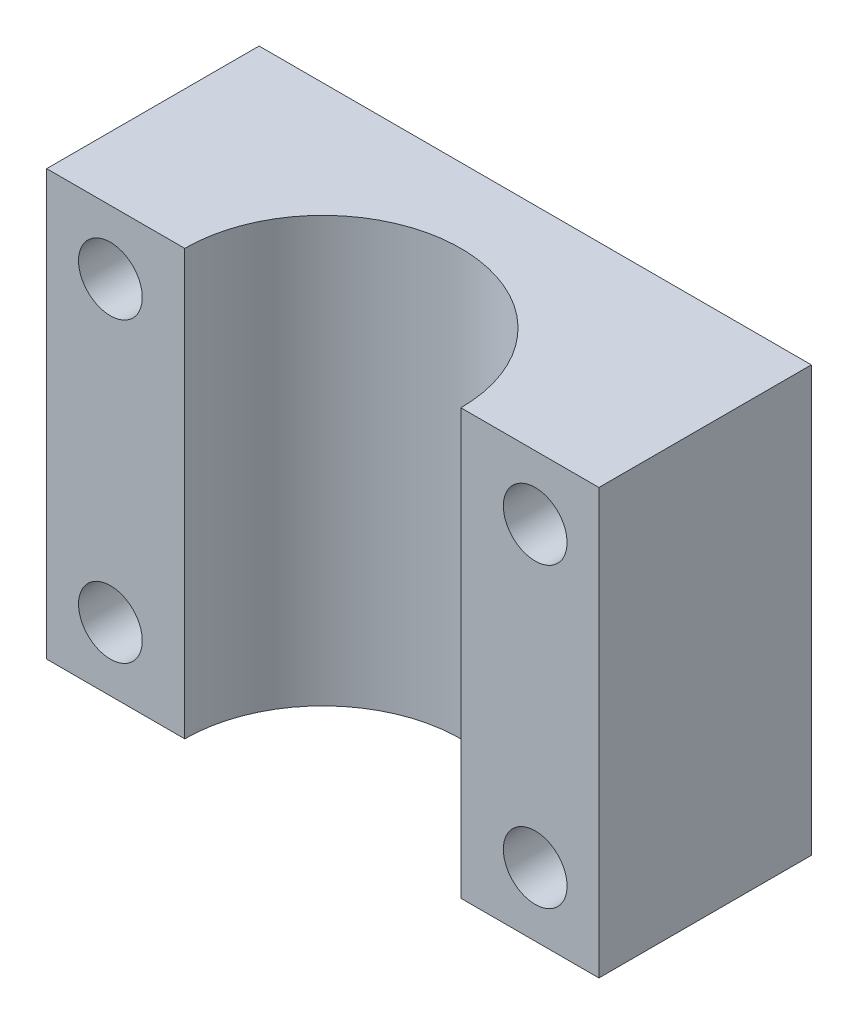
ISO-10303-21;
HEADER;
FILE_DESCRIPTION(('STEP AP214'),'2;1');
FILE_NAME('part.step','',(''),(''),'','','');
FILE_SCHEMA(('AUTOMOTIVE_DESIGN { 1 0 10303 214 1 1 1 1 }'));
ENDSEC;
DATA;
#1=APPLICATION_CONTEXT('core data for automotive mechanical design processes');
#2=APPLICATION_PROTOCOL_DEFINITION('international standard','automotive_design',2000,#1);
#3=PRODUCT_CONTEXT('',#1,'mechanical');
#4=PRODUCT('Part','Part','',(#3));
#5=PRODUCT_RELATED_PRODUCT_CATEGORY('part','',(#4));
#6=PRODUCT_DEFINITION_FORMATION('','',#4);
#7=PRODUCT_DEFINITION_CONTEXT('part definition',#1,'design');
#8=PRODUCT_DEFINITION('design','',#6,#7);
#9=PRODUCT_DEFINITION_SHAPE('','',#8);
#10=(LENGTH_UNIT() NAMED_UNIT(*) SI_UNIT(.MILLI.,.METRE.));
#11=(NAMED_UNIT(*) PLANE_ANGLE_UNIT() SI_UNIT($,.RADIAN.));
#12=(NAMED_UNIT(*) SI_UNIT($,.STERADIAN.) SOLID_ANGLE_UNIT());
#13=UNCERTAINTY_MEASURE_WITH_UNIT(LENGTH_MEASURE(1.E-05),#10,'distance_accuracy_value','');
#14=(GEOMETRIC_REPRESENTATION_CONTEXT(3) GLOBAL_UNCERTAINTY_ASSIGNED_CONTEXT((#13)) GLOBAL_UNIT_ASSIGNED_CONTEXT((#10,
#11,#12)) REPRESENTATION_CONTEXT('',''));
#15=CARTESIAN_POINT('',(0.,0.,0.));
#16=DIRECTION('',(0.,0.,1.));
#17=DIRECTION('',(1.,0.,0.));
#18=AXIS2_PLACEMENT_3D('',#15,#16,#17);
#19=CARTESIAN_POINT('',(0.,20.,0.));
#20=DIRECTION('',(0.,0.,-1.));
#21=DIRECTION('',(-1.,0.,0.));
#22=AXIS2_PLACEMENT_3D('',#19,#20,#21);
#23=PLANE('',#22);
#24=CARTESIAN_POINT('',(3.,3.,0.));
#25=DIRECTION('',(0.,0.,-1.));
#26=DIRECTION('',(-1.,0.,0.));
#27=AXIS2_PLACEMENT_3D('',#24,#25,#26);
#28=CIRCLE('',#27,1.5);
#29=CARTESIAN_POINT('',(1.5,3.,0.));
#30=VERTEX_POINT('',#29);
#31=EDGE_CURVE('E159',#30,#30,#28,.T.);
#32=ORIENTED_EDGE('',*,*,#31,.T.);
#33=EDGE_LOOP('',(#32));
#34=FACE_BOUND('',#33,.T.);
#35=CARTESIAN_POINT('',(3.,17.,0.));
#36=DIRECTION('',(0.,0.,-1.));
#37=DIRECTION('',(-1.,0.,0.));
#38=AXIS2_PLACEMENT_3D('',#35,#36,#37);
#39=CIRCLE('',#38,1.5);
#40=CARTESIAN_POINT('',(1.5,17.,0.));
#41=VERTEX_POINT('',#40);
#42=EDGE_CURVE('E147',#41,#41,#39,.T.);
#43=ORIENTED_EDGE('',*,*,#42,.T.);
#44=EDGE_LOOP('',(#43));
#45=FACE_BOUND('',#44,.T.);
#46=DIRECTION('',(1.,0.,0.));
#47=VECTOR('',#46,1.);
#48=CARTESIAN_POINT('',(0.,0.,0.));
#49=LINE('',#48,#47);
#50=CARTESIAN_POINT('',(0.,0.,0.));
#51=VERTEX_POINT('',#50);
#52=CARTESIAN_POINT('',(6.5,0.,0.));
#53=VERTEX_POINT('',#52);
#54=EDGE_CURVE('E120',#51,#53,#49,.T.);
#55=ORIENTED_EDGE('',*,*,#54,.T.);
#56=DIRECTION('',(0.,1.,0.));
#57=VECTOR('',#56,1.);
#58=CARTESIAN_POINT('',(6.5,0.,0.));
#59=LINE('',#58,#57);
#60=CARTESIAN_POINT('',(6.5,20.,0.));
#61=VERTEX_POINT('',#60);
#62=EDGE_CURVE('E54',#53,#61,#59,.T.);
#63=ORIENTED_EDGE('',*,*,#62,.T.);
#64=DIRECTION('',(1.,0.,0.));
#65=VECTOR('',#64,1.);
#66=CARTESIAN_POINT('',(0.,20.,0.));
#67=LINE('',#66,#65);
#68=CARTESIAN_POINT('',(0.,20.,0.));
#69=VERTEX_POINT('',#68);
#70=EDGE_CURVE('E90',#69,#61,#67,.T.);
#71=ORIENTED_EDGE('',*,*,#70,.F.);
#72=DIRECTION('',(0.,-1.,0.));
#73=VECTOR('',#72,1.);
#74=CARTESIAN_POINT('',(0.,20.,0.));
#75=LINE('',#74,#73);
#76=EDGE_CURVE('E11',#69,#51,#75,.T.);
#77=ORIENTED_EDGE('',*,*,#76,.T.);
#78=EDGE_LOOP('',(#55,#63,#71,#77));
#79=FACE_BOUND('',#78,.T.);
#80=ADVANCED_FACE('F39',(#34,#45,#79),#23,.F.);
#81=CARTESIAN_POINT('',(0.,20.,0.));
#82=DIRECTION('',(1.,0.,0.));
#83=DIRECTION('',(0.,0.,-1.));
#84=AXIS2_PLACEMENT_3D('',#81,#82,#83);
#85=PLANE('',#84);
#86=DIRECTION('',(0.,0.,1.));
#87=VECTOR('',#86,1.);
#88=CARTESIAN_POINT('',(0.,0.,0.));
#89=LINE('',#88,#87);
#90=CARTESIAN_POINT('',(0.,0.,-10.));
#91=VERTEX_POINT('',#90);
#92=EDGE_CURVE('E115',#91,#51,#89,.T.);
#93=ORIENTED_EDGE('',*,*,#92,.T.);
#94=ORIENTED_EDGE('',*,*,#76,.F.);
#95=DIRECTION('',(0.,0.,1.));
#96=VECTOR('',#95,1.);
#97=CARTESIAN_POINT('',(0.,20.,0.));
#98=LINE('',#97,#96);
#99=CARTESIAN_POINT('',(0.,20.,-10.));
#100=VERTEX_POINT('',#99);
#101=EDGE_CURVE('E128',#100,#69,#98,.T.);
#102=ORIENTED_EDGE('',*,*,#101,.F.);
#103=DIRECTION('',(0.,-1.,0.));
#104=VECTOR('',#103,1.);
#105=CARTESIAN_POINT('',(0.,20.,-10.));
#106=LINE('',#105,#104);
#107=EDGE_CURVE('E129',#100,#91,#106,.T.);
#108=ORIENTED_EDGE('',*,*,#107,.T.);
#109=EDGE_LOOP('',(#93,#94,#102,#108));
#110=FACE_BOUND('',#109,.T.);
#111=ADVANCED_FACE('F41',(#110),#85,.F.);
#112=CARTESIAN_POINT('',(23.,3.,0.));
#113=DIRECTION('',(0.,0.,-1.));
#114=DIRECTION('',(-1.,0.,0.));
#115=AXIS2_PLACEMENT_3D('',#112,#113,#114);
#116=CIRCLE('',#115,1.5);
#117=CARTESIAN_POINT('',(21.5,3.,0.));
#118=VERTEX_POINT('',#117);
#119=EDGE_CURVE('E153',#118,#118,#116,.T.);
#120=ORIENTED_EDGE('',*,*,#119,.T.);
#121=EDGE_LOOP('',(#120));
#122=FACE_BOUND('',#121,.T.);
#123=CARTESIAN_POINT('',(23.,17.,0.));
#124=DIRECTION('',(0.,0.,-1.));
#125=DIRECTION('',(-1.,0.,0.));
#126=AXIS2_PLACEMENT_3D('',#123,#124,#125);
#127=CIRCLE('',#126,1.5);
#128=CARTESIAN_POINT('',(21.5,17.,0.));
#129=VERTEX_POINT('',#128);
#130=EDGE_CURVE('E142',#129,#129,#127,.T.);
#131=ORIENTED_EDGE('',*,*,#130,.T.);
#132=EDGE_LOOP('',(#131));
#133=FACE_BOUND('',#132,.T.);
#134=CARTESIAN_POINT('',(19.5,20.,0.));
#135=VERTEX_POINT('',#134);
#136=CARTESIAN_POINT('',(26.,20.,0.));
#137=VERTEX_POINT('',#136);
#138=EDGE_CURVE('E114',#135,#137,#67,.T.);
#139=ORIENTED_EDGE('',*,*,#138,.F.);
#140=DIRECTION('',(0.,1.,0.));
#141=VECTOR('',#140,1.);
#142=CARTESIAN_POINT('',(19.5,0.,0.));
#143=LINE('',#142,#141);
#144=CARTESIAN_POINT('',(19.5,0.,0.));
#145=VERTEX_POINT('',#144);
#146=EDGE_CURVE('E101',#145,#135,#143,.T.);
#147=ORIENTED_EDGE('',*,*,#146,.F.);
#148=CARTESIAN_POINT('',(26.,0.,0.));
#149=VERTEX_POINT('',#148);
#150=EDGE_CURVE('E112',#145,#149,#49,.T.);
#151=ORIENTED_EDGE('',*,*,#150,.T.);
#152=DIRECTION('',(0.,-1.,0.));
#153=VECTOR('',#152,1.);
#154=CARTESIAN_POINT('',(26.,20.,0.));
#155=LINE('',#154,#153);
#156=EDGE_CURVE('E47',#137,#149,#155,.T.);
#157=ORIENTED_EDGE('',*,*,#156,.F.);
#158=EDGE_LOOP('',(#139,#147,#151,#157));
#159=FACE_BOUND('',#158,.T.);
#160=ADVANCED_FACE('F110',(#122,#133,#159),#23,.F.);
#161=CARTESIAN_POINT('',(26.,20.,0.));
#162=DIRECTION('',(-1.,0.,0.));
#163=DIRECTION('',(0.,0.,1.));
#164=AXIS2_PLACEMENT_3D('',#161,#162,#163);
#165=PLANE('',#164);
#166=DIRECTION('',(0.,0.,-1.));
#167=VECTOR('',#166,1.);
#168=CARTESIAN_POINT('',(26.,0.,0.));
#169=LINE('',#168,#167);
#170=CARTESIAN_POINT('',(26.,0.,-10.));
#171=VERTEX_POINT('',#170);
#172=EDGE_CURVE('E119',#149,#171,#169,.T.);
#173=ORIENTED_EDGE('',*,*,#172,.T.);
#174=DIRECTION('',(0.,-1.,0.));
#175=VECTOR('',#174,1.);
#176=CARTESIAN_POINT('',(26.,20.,-10.));
#177=LINE('',#176,#175);
#178=CARTESIAN_POINT('',(26.,20.,-10.));
#179=VERTEX_POINT('',#178);
#180=EDGE_CURVE('E131',#179,#171,#177,.T.);
#181=ORIENTED_EDGE('',*,*,#180,.F.);
#182=DIRECTION('',(0.,0.,-1.));
#183=VECTOR('',#182,1.);
#184=CARTESIAN_POINT('',(26.,20.,0.));
#185=LINE('',#184,#183);
#186=EDGE_CURVE('E136',#137,#179,#185,.T.);
#187=ORIENTED_EDGE('',*,*,#186,.F.);
#188=ORIENTED_EDGE('',*,*,#156,.T.);
#189=EDGE_LOOP('',(#173,#181,#187,#188));
#190=FACE_BOUND('',#189,.T.);
#191=ADVANCED_FACE('F134',(#190),#165,.F.);
#192=CARTESIAN_POINT('',(0.,20.,-10.));
#193=DIRECTION('',(0.,0.,1.));
#194=DIRECTION('',(1.,0.,0.));
#195=AXIS2_PLACEMENT_3D('',#192,#193,#194);
#196=PLANE('',#195);
#197=CARTESIAN_POINT('',(23.,3.,-10.));
#198=DIRECTION('',(0.,0.,-1.));
#199=DIRECTION('',(-1.,0.,0.));
#200=AXIS2_PLACEMENT_3D('',#197,#198,#199);
#201=CIRCLE('',#200,1.5);
#202=CARTESIAN_POINT('',(21.5,3.,-10.));
#203=VERTEX_POINT('',#202);
#204=EDGE_CURVE('E150',#203,#203,#201,.T.);
#205=ORIENTED_EDGE('',*,*,#204,.F.);
#206=EDGE_LOOP('',(#205));
#207=FACE_BOUND('',#206,.T.);
#208=CARTESIAN_POINT('',(3.,3.,-10.));
#209=DIRECTION('',(0.,0.,-1.));
#210=DIRECTION('',(-1.,0.,0.));
#211=AXIS2_PLACEMENT_3D('',#208,#209,#210);
#212=CIRCLE('',#211,1.5);
#213=CARTESIAN_POINT('',(1.5,3.,-10.));
#214=VERTEX_POINT('',#213);
#215=EDGE_CURVE('E156',#214,#214,#212,.T.);
#216=ORIENTED_EDGE('',*,*,#215,.F.);
#217=EDGE_LOOP('',(#216));
#218=FACE_BOUND('',#217,.T.);
#219=CARTESIAN_POINT('',(3.,17.,-10.));
#220=DIRECTION('',(0.,0.,-1.));
#221=DIRECTION('',(-1.,0.,0.));
#222=AXIS2_PLACEMENT_3D('',#219,#220,#221);
#223=CIRCLE('',#222,1.5);
#224=CARTESIAN_POINT('',(1.5,17.,-10.));
#225=VERTEX_POINT('',#224);
#226=EDGE_CURVE('E162',#225,#225,#223,.T.);
#227=ORIENTED_EDGE('',*,*,#226,.F.);
#228=EDGE_LOOP('',(#227));
#229=FACE_BOUND('',#228,.T.);
#230=CARTESIAN_POINT('',(23.,17.,-10.));
#231=DIRECTION('',(0.,0.,-1.));
#232=DIRECTION('',(-1.,0.,0.));
#233=AXIS2_PLACEMENT_3D('',#230,#231,#232);
#234=CIRCLE('',#233,1.5);
#235=CARTESIAN_POINT('',(21.5,17.,-10.));
#236=VERTEX_POINT('',#235);
#237=EDGE_CURVE('E144',#236,#236,#234,.T.);
#238=ORIENTED_EDGE('',*,*,#237,.F.);
#239=EDGE_LOOP('',(#238));
#240=FACE_BOUND('',#239,.T.);
#241=DIRECTION('',(-1.,0.,0.));
#242=VECTOR('',#241,1.);
#243=CARTESIAN_POINT('',(0.,0.,-10.));
#244=LINE('',#243,#242);
#245=EDGE_CURVE('E84',#171,#91,#244,.T.);
#246=ORIENTED_EDGE('',*,*,#245,.T.);
#247=ORIENTED_EDGE('',*,*,#107,.F.);
#248=DIRECTION('',(-1.,0.,0.));
#249=VECTOR('',#248,1.);
#250=CARTESIAN_POINT('',(0.,20.,-10.));
#251=LINE('',#250,#249);
#252=EDGE_CURVE('E63',#179,#100,#251,.T.);
#253=ORIENTED_EDGE('',*,*,#252,.F.);
#254=ORIENTED_EDGE('',*,*,#180,.T.);
#255=EDGE_LOOP('',(#246,#247,#253,#254));
#256=FACE_BOUND('',#255,.T.);
#257=ADVANCED_FACE('F177',(#207,#218,#229,#240,#256),#196,.F.);
#258=CARTESIAN_POINT('',(0.,20.,0.));
#259=DIRECTION('',(0.,-1.,0.));
#260=DIRECTION('',(0.,0.,-1.));
#261=AXIS2_PLACEMENT_3D('',#258,#259,#260);
#262=PLANE('',#261);
#263=ORIENTED_EDGE('',*,*,#70,.T.);
#264=CARTESIAN_POINT('',(13.,20.,0.));
#265=DIRECTION('',(0.,1.,0.));
#266=DIRECTION('',(0.,0.,1.));
#267=AXIS2_PLACEMENT_3D('',#264,#265,#266);
#268=CIRCLE('',#267,6.5);
#269=EDGE_CURVE('E106',#135,#61,#268,.T.);
#270=ORIENTED_EDGE('',*,*,#269,.F.);
#271=ORIENTED_EDGE('',*,*,#138,.T.);
#272=ORIENTED_EDGE('',*,*,#186,.T.);
#273=ORIENTED_EDGE('',*,*,#252,.T.);
#274=ORIENTED_EDGE('',*,*,#101,.T.);
#275=EDGE_LOOP('',(#263,#270,#271,#272,#273,#274));
#276=FACE_BOUND('',#275,.T.);
#277=ADVANCED_FACE('F180',(#276),#262,.F.);
#278=CARTESIAN_POINT('',(0.,0.,0.));
#279=DIRECTION('',(0.,-1.,0.));
#280=DIRECTION('',(0.,0.,-1.));
#281=AXIS2_PLACEMENT_3D('',#278,#279,#280);
#282=PLANE('',#281);
#283=CARTESIAN_POINT('',(13.,0.,0.));
#284=DIRECTION('',(0.,1.,0.));
#285=DIRECTION('',(0.,0.,1.));
#286=AXIS2_PLACEMENT_3D('',#283,#284,#285);
#287=CIRCLE('',#286,6.5);
#288=EDGE_CURVE('E98',#145,#53,#287,.T.);
#289=ORIENTED_EDGE('',*,*,#288,.T.);
#290=ORIENTED_EDGE('',*,*,#54,.F.);
#291=ORIENTED_EDGE('',*,*,#92,.F.);
#292=ORIENTED_EDGE('',*,*,#245,.F.);
#293=ORIENTED_EDGE('',*,*,#172,.F.);
#294=ORIENTED_EDGE('',*,*,#150,.F.);
#295=EDGE_LOOP('',(#289,#290,#291,#292,#293,#294));
#296=FACE_BOUND('',#295,.T.);
#297=ADVANCED_FACE('F118',(#296),#282,.T.);
#298=CARTESIAN_POINT('',(13.,0.,0.));
#299=DIRECTION('',(0.,1.,0.));
#300=DIRECTION('',(0.,0.,1.));
#301=AXIS2_PLACEMENT_3D('',#298,#299,#300);
#302=CYLINDRICAL_SURFACE('',#301,6.5);
#303=ORIENTED_EDGE('',*,*,#269,.T.);
#304=ORIENTED_EDGE('',*,*,#62,.F.);
#305=ORIENTED_EDGE('',*,*,#288,.F.);
#306=ORIENTED_EDGE('',*,*,#146,.T.);
#307=EDGE_LOOP('',(#303,#304,#305,#306));
#308=FACE_BOUND('',#307,.T.);
#309=ADVANCED_FACE('F100',(#308),#302,.F.);
#310=CARTESIAN_POINT('',(23.,17.,0.));
#311=DIRECTION('',(0.,0.,-1.));
#312=DIRECTION('',(-1.,0.,0.));
#313=AXIS2_PLACEMENT_3D('',#310,#311,#312);
#314=CYLINDRICAL_SURFACE('',#313,1.5);
#315=ORIENTED_EDGE('',*,*,#130,.F.);
#316=EDGE_LOOP('',(#315));
#317=FACE_BOUND('',#316,.T.);
#318=ORIENTED_EDGE('',*,*,#237,.T.);
#319=EDGE_LOOP('',(#318));
#320=FACE_BOUND('',#319,.T.);
#321=ADVANCED_FACE('F173',(#317,#320),#314,.F.);
#322=CARTESIAN_POINT('',(3.,17.,0.));
#323=DIRECTION('',(0.,0.,-1.));
#324=DIRECTION('',(-1.,0.,0.));
#325=AXIS2_PLACEMENT_3D('',#322,#323,#324);
#326=CYLINDRICAL_SURFACE('',#325,1.5);
#327=ORIENTED_EDGE('',*,*,#42,.F.);
#328=EDGE_LOOP('',(#327));
#329=FACE_BOUND('',#328,.T.);
#330=ORIENTED_EDGE('',*,*,#226,.T.);
#331=EDGE_LOOP('',(#330));
#332=FACE_BOUND('',#331,.T.);
#333=ADVANCED_FACE('F169',(#329,#332),#326,.F.);
#334=CARTESIAN_POINT('',(3.,3.,0.));
#335=DIRECTION('',(0.,0.,-1.));
#336=DIRECTION('',(-1.,0.,0.));
#337=AXIS2_PLACEMENT_3D('',#334,#335,#336);
#338=CYLINDRICAL_SURFACE('',#337,1.5);
#339=ORIENTED_EDGE('',*,*,#31,.F.);
#340=EDGE_LOOP('',(#339));
#341=FACE_BOUND('',#340,.T.);
#342=ORIENTED_EDGE('',*,*,#215,.T.);
#343=EDGE_LOOP('',(#342));
#344=FACE_BOUND('',#343,.T.);
#345=ADVANCED_FACE('F172',(#341,#344),#338,.F.);
#346=CARTESIAN_POINT('',(23.,3.,0.));
#347=DIRECTION('',(0.,0.,-1.));
#348=DIRECTION('',(-1.,0.,0.));
#349=AXIS2_PLACEMENT_3D('',#346,#347,#348);
#350=CYLINDRICAL_SURFACE('',#349,1.5);
#351=ORIENTED_EDGE('',*,*,#119,.F.);
#352=EDGE_LOOP('',(#351));
#353=FACE_BOUND('',#352,.T.);
#354=ORIENTED_EDGE('',*,*,#204,.T.);
#355=EDGE_LOOP('',(#354));
#356=FACE_BOUND('',#355,.T.);
#357=ADVANCED_FACE('F209',(#353,#356),#350,.F.);
#358=CLOSED_SHELL('',(#80,#111,#160,#191,#257,#277,#297,#309,#321,#333,#345,#357));
#359=MANIFOLD_SOLID_BREP('B2',#358);
#360=ADVANCED_BREP_SHAPE_REPRESENTATION('',(#18,#359),#14);
#361=SHAPE_DEFINITION_REPRESENTATION(#9,#360);
ENDSEC;
END-ISO-10303-21;
